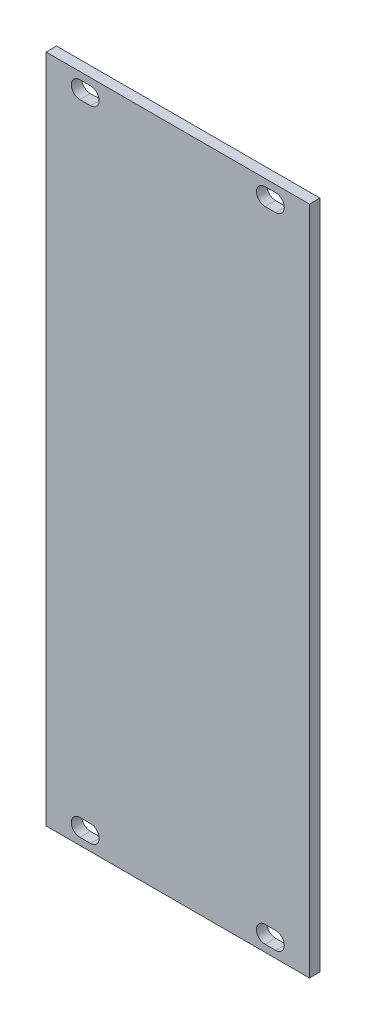
ISO-10303-21;
HEADER;
FILE_DESCRIPTION(('STEP AP214'),'2;1');
FILE_NAME('part.step','',(''),(''),'','','');
FILE_SCHEMA(('AUTOMOTIVE_DESIGN { 1 0 10303 214 1 1 1 1 }'));
ENDSEC;
DATA;
#1=APPLICATION_CONTEXT('core data for automotive mechanical design processes');
#2=APPLICATION_PROTOCOL_DEFINITION('international standard','automotive_design',2000,#1);
#3=PRODUCT_CONTEXT('',#1,'mechanical');
#4=PRODUCT('Part','Part','',(#3));
#5=PRODUCT_RELATED_PRODUCT_CATEGORY('part','',(#4));
#6=PRODUCT_DEFINITION_FORMATION('','',#4);
#7=PRODUCT_DEFINITION_CONTEXT('part definition',#1,'design');
#8=PRODUCT_DEFINITION('design','',#6,#7);
#9=PRODUCT_DEFINITION_SHAPE('','',#8);
#10=(LENGTH_UNIT() NAMED_UNIT(*) SI_UNIT(.MILLI.,.METRE.));
#11=(NAMED_UNIT(*) PLANE_ANGLE_UNIT() SI_UNIT($,.RADIAN.));
#12=(NAMED_UNIT(*) SI_UNIT($,.STERADIAN.) SOLID_ANGLE_UNIT());
#13=UNCERTAINTY_MEASURE_WITH_UNIT(LENGTH_MEASURE(1.E-05),#10,'distance_accuracy_value','');
#14=(GEOMETRIC_REPRESENTATION_CONTEXT(3) GLOBAL_UNCERTAINTY_ASSIGNED_CONTEXT((#13)) GLOBAL_UNIT_ASSIGNED_CONTEXT((#10,
#11,#12)) REPRESENTATION_CONTEXT('',''));
#15=CARTESIAN_POINT('',(0.,0.,0.));
#16=DIRECTION('',(0.,0.,1.));
#17=DIRECTION('',(1.,0.,0.));
#18=AXIS2_PLACEMENT_3D('',#15,#16,#17);
#19=CARTESIAN_POINT('',(0.,0.,2.));
#20=DIRECTION('',(0.,0.,1.));
#21=DIRECTION('',(1.,0.,0.));
#22=AXIS2_PLACEMENT_3D('',#19,#20,#21);
#23=PLANE('',#22);
#24=DIRECTION('',(0.,1.,0.));
#25=VECTOR('',#24,1.);
#26=CARTESIAN_POINT('',(25.25,64.25,2.));
#27=LINE('',#26,#25);
#28=CARTESIAN_POINT('',(25.25,-64.25,2.));
#29=VERTEX_POINT('',#28);
#30=CARTESIAN_POINT('',(25.25,64.25,2.));
#31=VERTEX_POINT('',#30);
#32=EDGE_CURVE('E360',#29,#31,#27,.T.);
#33=ORIENTED_EDGE('',*,*,#32,.T.);
#34=DIRECTION('',(-1.,0.,0.));
#35=VECTOR('',#34,1.);
#36=CARTESIAN_POINT('',(-25.25,64.25,2.));
#37=LINE('',#36,#35);
#38=CARTESIAN_POINT('',(-25.25,64.25,2.));
#39=VERTEX_POINT('',#38);
#40=EDGE_CURVE('E364',#31,#39,#37,.T.);
#41=ORIENTED_EDGE('',*,*,#40,.T.);
#42=DIRECTION('',(0.,-1.,0.));
#43=VECTOR('',#42,1.);
#44=CARTESIAN_POINT('',(-25.25,64.25,2.));
#45=LINE('',#44,#43);
#46=CARTESIAN_POINT('',(-25.25,-64.25,2.));
#47=VERTEX_POINT('',#46);
#48=EDGE_CURVE('E368',#39,#47,#45,.T.);
#49=ORIENTED_EDGE('',*,*,#48,.T.);
#50=DIRECTION('',(1.,0.,0.));
#51=VECTOR('',#50,1.);
#52=CARTESIAN_POINT('',(-25.25,-64.25,2.));
#53=LINE('',#52,#51);
#54=EDGE_CURVE('E371',#47,#29,#53,.T.);
#55=ORIENTED_EDGE('',*,*,#54,.T.);
#56=EDGE_LOOP('',(#33,#41,#49,#55));
#57=FACE_BOUND('',#56,.T.);
#58=DIRECTION('',(1.,0.,0.));
#59=VECTOR('',#58,1.);
#60=CARTESIAN_POINT('',(-18.766,-62.9,2.));
#61=LINE('',#60,#59);
#62=CARTESIAN_POINT('',(-18.766,-62.9,2.));
#63=VERTEX_POINT('',#62);
#64=CARTESIAN_POINT('',(-16.734,-62.9,2.));
#65=VERTEX_POINT('',#64);
#66=EDGE_CURVE('E320',#63,#65,#61,.T.);
#67=ORIENTED_EDGE('',*,*,#66,.F.);
#68=CARTESIAN_POINT('',(-18.766,-61.25,2.));
#69=DIRECTION('',(0.,0.,1.));
#70=DIRECTION('',(1.,0.,0.));
#71=AXIS2_PLACEMENT_3D('',#68,#69,#70);
#72=CIRCLE('',#71,1.65);
#73=CARTESIAN_POINT('',(-18.766,-59.6,2.));
#74=VERTEX_POINT('',#73);
#75=EDGE_CURVE('E317',#74,#63,#72,.T.);
#76=ORIENTED_EDGE('',*,*,#75,.F.);
#77=DIRECTION('',(-1.,0.,0.));
#78=VECTOR('',#77,1.);
#79=CARTESIAN_POINT('',(-18.766,-59.6,2.));
#80=LINE('',#79,#78);
#81=CARTESIAN_POINT('',(-16.734,-59.6,2.));
#82=VERTEX_POINT('',#81);
#83=EDGE_CURVE('E328',#82,#74,#80,.T.);
#84=ORIENTED_EDGE('',*,*,#83,.F.);
#85=CARTESIAN_POINT('',(-16.734,-61.25,2.));
#86=DIRECTION('',(0.,0.,1.));
#87=DIRECTION('',(1.,0.,0.));
#88=AXIS2_PLACEMENT_3D('',#85,#86,#87);
#89=CIRCLE('',#88,1.64999999999999);
#90=EDGE_CURVE('E324',#65,#82,#89,.T.);
#91=ORIENTED_EDGE('',*,*,#90,.F.);
#92=EDGE_LOOP('',(#67,#76,#84,#91));
#93=FACE_BOUND('',#92,.T.);
#94=DIRECTION('',(1.,0.,0.));
#95=VECTOR('',#94,1.);
#96=CARTESIAN_POINT('',(16.734000014,59.6,2.));
#97=LINE('',#96,#95);
#98=CARTESIAN_POINT('',(16.734000014,59.6,2.));
#99=VERTEX_POINT('',#98);
#100=CARTESIAN_POINT('',(18.766000014,59.6,2.));
#101=VERTEX_POINT('',#100);
#102=EDGE_CURVE('E277',#99,#101,#97,.T.);
#103=ORIENTED_EDGE('',*,*,#102,.F.);
#104=CARTESIAN_POINT('',(16.734000014,61.25,2.));
#105=DIRECTION('',(0.,0.,1.));
#106=DIRECTION('',(1.,0.,0.));
#107=AXIS2_PLACEMENT_3D('',#104,#105,#106);
#108=CIRCLE('',#107,1.64999999999999);
#109=CARTESIAN_POINT('',(16.734000014,62.9,2.));
#110=VERTEX_POINT('',#109);
#111=EDGE_CURVE('E274',#110,#99,#108,.T.);
#112=ORIENTED_EDGE('',*,*,#111,.F.);
#113=DIRECTION('',(-1.,0.,0.));
#114=VECTOR('',#113,1.);
#115=CARTESIAN_POINT('',(16.734000014,62.9,2.));
#116=LINE('',#115,#114);
#117=CARTESIAN_POINT('',(18.766000014,62.9,2.));
#118=VERTEX_POINT('',#117);
#119=EDGE_CURVE('E285',#118,#110,#116,.T.);
#120=ORIENTED_EDGE('',*,*,#119,.F.);
#121=CARTESIAN_POINT('',(18.766000014,61.25,2.));
#122=DIRECTION('',(0.,0.,1.));
#123=DIRECTION('',(1.,0.,0.));
#124=AXIS2_PLACEMENT_3D('',#121,#122,#123);
#125=CIRCLE('',#124,1.64999999999999);
#126=EDGE_CURVE('E281',#101,#118,#125,.T.);
#127=ORIENTED_EDGE('',*,*,#126,.F.);
#128=EDGE_LOOP('',(#103,#112,#120,#127));
#129=FACE_BOUND('',#128,.T.);
#130=DIRECTION('',(1.,0.,0.));
#131=VECTOR('',#130,1.);
#132=CARTESIAN_POINT('',(-18.766,59.6,2.));
#133=LINE('',#132,#131);
#134=CARTESIAN_POINT('',(-18.766,59.6,2.));
#135=VERTEX_POINT('',#134);
#136=CARTESIAN_POINT('',(-16.734,59.6,2.));
#137=VERTEX_POINT('',#136);
#138=EDGE_CURVE('E234',#135,#137,#133,.T.);
#139=ORIENTED_EDGE('',*,*,#138,.F.);
#140=CARTESIAN_POINT('',(-18.766,61.25,2.));
#141=DIRECTION('',(0.,0.,1.));
#142=DIRECTION('',(1.,0.,0.));
#143=AXIS2_PLACEMENT_3D('',#140,#141,#142);
#144=CIRCLE('',#143,1.64999999999999);
#145=CARTESIAN_POINT('',(-18.766,62.9,2.));
#146=VERTEX_POINT('',#145);
#147=EDGE_CURVE('E231',#146,#135,#144,.T.);
#148=ORIENTED_EDGE('',*,*,#147,.F.);
#149=DIRECTION('',(-1.,0.,0.));
#150=VECTOR('',#149,1.);
#151=CARTESIAN_POINT('',(-18.766,62.9,2.));
#152=LINE('',#151,#150);
#153=CARTESIAN_POINT('',(-16.734,62.9,2.));
#154=VERTEX_POINT('',#153);
#155=EDGE_CURVE('E242',#154,#146,#152,.T.);
#156=ORIENTED_EDGE('',*,*,#155,.F.);
#157=CARTESIAN_POINT('',(-16.734,61.25,2.));
#158=DIRECTION('',(0.,0.,1.));
#159=DIRECTION('',(1.,0.,0.));
#160=AXIS2_PLACEMENT_3D('',#157,#158,#159);
#161=CIRCLE('',#160,1.64999999999999);
#162=EDGE_CURVE('E238',#137,#154,#161,.T.);
#163=ORIENTED_EDGE('',*,*,#162,.F.);
#164=EDGE_LOOP('',(#139,#148,#156,#163));
#165=FACE_BOUND('',#164,.T.);
#166=DIRECTION('',(1.,0.,0.));
#167=VECTOR('',#166,1.);
#168=CARTESIAN_POINT('',(16.734000014,-62.9,2.));
#169=LINE('',#168,#167);
#170=CARTESIAN_POINT('',(16.734000014,-62.9,2.));
#171=VERTEX_POINT('',#170);
#172=CARTESIAN_POINT('',(18.766000014,-62.9,2.));
#173=VERTEX_POINT('',#172);
#174=EDGE_CURVE('E192',#171,#173,#169,.T.);
#175=ORIENTED_EDGE('',*,*,#174,.F.);
#176=CARTESIAN_POINT('',(16.734000014,-61.25,2.));
#177=DIRECTION('',(0.,0.,1.));
#178=DIRECTION('',(1.,0.,0.));
#179=AXIS2_PLACEMENT_3D('',#176,#177,#178);
#180=CIRCLE('',#179,1.65);
#181=CARTESIAN_POINT('',(16.734000014,-59.6,2.));
#182=VERTEX_POINT('',#181);
#183=EDGE_CURVE('E183',#182,#171,#180,.T.);
#184=ORIENTED_EDGE('',*,*,#183,.F.);
#185=DIRECTION('',(-1.,0.,0.));
#186=VECTOR('',#185,1.);
#187=CARTESIAN_POINT('',(16.734000014,-59.6,2.));
#188=LINE('',#187,#186);
#189=CARTESIAN_POINT('',(18.766000014,-59.6,2.));
#190=VERTEX_POINT('',#189);
#191=EDGE_CURVE('E209',#190,#182,#188,.T.);
#192=ORIENTED_EDGE('',*,*,#191,.F.);
#193=CARTESIAN_POINT('',(18.766000014,-61.25,2.));
#194=DIRECTION('',(0.,0.,1.));
#195=DIRECTION('',(1.,0.,0.));
#196=AXIS2_PLACEMENT_3D('',#193,#194,#195);
#197=CIRCLE('',#196,1.65);
#198=EDGE_CURVE('E205',#173,#190,#197,.T.);
#199=ORIENTED_EDGE('',*,*,#198,.F.);
#200=EDGE_LOOP('',(#175,#184,#192,#199));
#201=FACE_BOUND('',#200,.T.);
#202=ADVANCED_FACE('F45',(#57,#93,#129,#165,#201),#23,.T.);
#203=CARTESIAN_POINT('',(0.,0.,0.));
#204=DIRECTION('',(0.,0.,1.));
#205=DIRECTION('',(1.,0.,0.));
#206=AXIS2_PLACEMENT_3D('',#203,#204,#205);
#207=PLANE('',#206);
#208=CARTESIAN_POINT('',(-18.766,61.25,0.));
#209=DIRECTION('',(0.,0.,1.));
#210=DIRECTION('',(1.,0.,0.));
#211=AXIS2_PLACEMENT_3D('',#208,#209,#210);
#212=CIRCLE('',#211,1.64999999999999);
#213=CARTESIAN_POINT('',(-18.766,62.9,0.));
#214=VERTEX_POINT('',#213);
#215=CARTESIAN_POINT('',(-18.766,59.6,0.));
#216=VERTEX_POINT('',#215);
#217=EDGE_CURVE('E201',#214,#216,#212,.T.);
#218=ORIENTED_EDGE('',*,*,#217,.T.);
#219=DIRECTION('',(1.,0.,0.));
#220=VECTOR('',#219,1.);
#221=CARTESIAN_POINT('',(-18.766,59.6,0.));
#222=LINE('',#221,#220);
#223=CARTESIAN_POINT('',(-16.734,59.6,0.));
#224=VERTEX_POINT('',#223);
#225=EDGE_CURVE('E249',#216,#224,#222,.T.);
#226=ORIENTED_EDGE('',*,*,#225,.T.);
#227=CARTESIAN_POINT('',(-16.734,61.25,0.));
#228=DIRECTION('',(0.,0.,1.));
#229=DIRECTION('',(1.,0.,0.));
#230=AXIS2_PLACEMENT_3D('',#227,#228,#229);
#231=CIRCLE('',#230,1.64999999999999);
#232=CARTESIAN_POINT('',(-16.734,62.9,0.));
#233=VERTEX_POINT('',#232);
#234=EDGE_CURVE('E253',#224,#233,#231,.T.);
#235=ORIENTED_EDGE('',*,*,#234,.T.);
#236=DIRECTION('',(-1.,0.,0.));
#237=VECTOR('',#236,1.);
#238=CARTESIAN_POINT('',(-18.766,62.9,0.));
#239=LINE('',#238,#237);
#240=EDGE_CURVE('E235',#233,#214,#239,.T.);
#241=ORIENTED_EDGE('',*,*,#240,.T.);
#242=EDGE_LOOP('',(#218,#226,#235,#241));
#243=FACE_BOUND('',#242,.T.);
#244=CARTESIAN_POINT('',(-18.766,-61.25,0.));
#245=DIRECTION('',(0.,0.,1.));
#246=DIRECTION('',(1.,0.,0.));
#247=AXIS2_PLACEMENT_3D('',#244,#245,#246);
#248=CIRCLE('',#247,1.65);
#249=CARTESIAN_POINT('',(-18.766,-59.6,0.));
#250=VERTEX_POINT('',#249);
#251=CARTESIAN_POINT('',(-18.766,-62.9,0.));
#252=VERTEX_POINT('',#251);
#253=EDGE_CURVE('E316',#250,#252,#248,.T.);
#254=ORIENTED_EDGE('',*,*,#253,.T.);
#255=DIRECTION('',(1.,0.,0.));
#256=VECTOR('',#255,1.);
#257=CARTESIAN_POINT('',(-18.766,-62.9,0.));
#258=LINE('',#257,#256);
#259=CARTESIAN_POINT('',(-16.734,-62.9,0.));
#260=VERTEX_POINT('',#259);
#261=EDGE_CURVE('E335',#252,#260,#258,.T.);
#262=ORIENTED_EDGE('',*,*,#261,.T.);
#263=CARTESIAN_POINT('',(-16.734,-61.25,0.));
#264=DIRECTION('',(0.,0.,1.));
#265=DIRECTION('',(1.,0.,0.));
#266=AXIS2_PLACEMENT_3D('',#263,#264,#265);
#267=CIRCLE('',#266,1.64999999999999);
#268=CARTESIAN_POINT('',(-16.734,-59.6,0.));
#269=VERTEX_POINT('',#268);
#270=EDGE_CURVE('E339',#260,#269,#267,.T.);
#271=ORIENTED_EDGE('',*,*,#270,.T.);
#272=DIRECTION('',(-1.,0.,0.));
#273=VECTOR('',#272,1.);
#274=CARTESIAN_POINT('',(-18.766,-59.6,0.));
#275=LINE('',#274,#273);
#276=EDGE_CURVE('E321',#269,#250,#275,.T.);
#277=ORIENTED_EDGE('',*,*,#276,.T.);
#278=EDGE_LOOP('',(#254,#262,#271,#277));
#279=FACE_BOUND('',#278,.T.);
#280=DIRECTION('',(0.,1.,0.));
#281=VECTOR('',#280,1.);
#282=CARTESIAN_POINT('',(25.25,64.25,0.));
#283=LINE('',#282,#281);
#284=CARTESIAN_POINT('',(25.25,-64.25,0.));
#285=VERTEX_POINT('',#284);
#286=CARTESIAN_POINT('',(25.25,64.25,0.));
#287=VERTEX_POINT('',#286);
#288=EDGE_CURVE('E359',#285,#287,#283,.T.);
#289=ORIENTED_EDGE('',*,*,#288,.F.);
#290=DIRECTION('',(1.,0.,0.));
#291=VECTOR('',#290,1.);
#292=CARTESIAN_POINT('',(-25.25,-64.25,0.));
#293=LINE('',#292,#291);
#294=CARTESIAN_POINT('',(-25.25,-64.25,0.));
#295=VERTEX_POINT('',#294);
#296=EDGE_CURVE('E365',#295,#285,#293,.T.);
#297=ORIENTED_EDGE('',*,*,#296,.F.);
#298=DIRECTION('',(0.,-1.,0.));
#299=VECTOR('',#298,1.);
#300=CARTESIAN_POINT('',(-25.25,64.25,0.));
#301=LINE('',#300,#299);
#302=CARTESIAN_POINT('',(-25.25,64.25,0.));
#303=VERTEX_POINT('',#302);
#304=EDGE_CURVE('E381',#303,#295,#301,.T.);
#305=ORIENTED_EDGE('',*,*,#304,.F.);
#306=DIRECTION('',(-1.,0.,0.));
#307=VECTOR('',#306,1.);
#308=CARTESIAN_POINT('',(-25.25,64.25,0.));
#309=LINE('',#308,#307);
#310=EDGE_CURVE('E378',#287,#303,#309,.T.);
#311=ORIENTED_EDGE('',*,*,#310,.F.);
#312=EDGE_LOOP('',(#289,#297,#305,#311));
#313=FACE_BOUND('',#312,.T.);
#314=CARTESIAN_POINT('',(16.734000014,61.25,0.));
#315=DIRECTION('',(0.,0.,1.));
#316=DIRECTION('',(1.,0.,0.));
#317=AXIS2_PLACEMENT_3D('',#314,#315,#316);
#318=CIRCLE('',#317,1.64999999999999);
#319=CARTESIAN_POINT('',(16.734000014,62.9,0.));
#320=VERTEX_POINT('',#319);
#321=CARTESIAN_POINT('',(16.734000014,59.6,0.));
#322=VERTEX_POINT('',#321);
#323=EDGE_CURVE('E273',#320,#322,#318,.T.);
#324=ORIENTED_EDGE('',*,*,#323,.T.);
#325=DIRECTION('',(1.,0.,0.));
#326=VECTOR('',#325,1.);
#327=CARTESIAN_POINT('',(16.734000014,59.6,0.));
#328=LINE('',#327,#326);
#329=CARTESIAN_POINT('',(18.766000014,59.6,0.));
#330=VERTEX_POINT('',#329);
#331=EDGE_CURVE('E292',#322,#330,#328,.T.);
#332=ORIENTED_EDGE('',*,*,#331,.T.);
#333=CARTESIAN_POINT('',(18.766000014,61.25,0.));
#334=DIRECTION('',(0.,0.,1.));
#335=DIRECTION('',(1.,0.,0.));
#336=AXIS2_PLACEMENT_3D('',#333,#334,#335);
#337=CIRCLE('',#336,1.64999999999999);
#338=CARTESIAN_POINT('',(18.766000014,62.9,0.));
#339=VERTEX_POINT('',#338);
#340=EDGE_CURVE('E296',#330,#339,#337,.T.);
#341=ORIENTED_EDGE('',*,*,#340,.T.);
#342=DIRECTION('',(-1.,0.,0.));
#343=VECTOR('',#342,1.);
#344=CARTESIAN_POINT('',(16.734000014,62.9,0.));
#345=LINE('',#344,#343);
#346=EDGE_CURVE('E278',#339,#320,#345,.T.);
#347=ORIENTED_EDGE('',*,*,#346,.T.);
#348=EDGE_LOOP('',(#324,#332,#341,#347));
#349=FACE_BOUND('',#348,.T.);
#350=CARTESIAN_POINT('',(16.734000014,-61.25,0.));
#351=DIRECTION('',(0.,0.,1.));
#352=DIRECTION('',(1.,0.,0.));
#353=AXIS2_PLACEMENT_3D('',#350,#351,#352);
#354=CIRCLE('',#353,1.65);
#355=CARTESIAN_POINT('',(16.734000014,-59.6,0.));
#356=VERTEX_POINT('',#355);
#357=CARTESIAN_POINT('',(16.734000014,-62.9,0.));
#358=VERTEX_POINT('',#357);
#359=EDGE_CURVE('E69',#356,#358,#354,.T.);
#360=ORIENTED_EDGE('',*,*,#359,.T.);
#361=DIRECTION('',(1.,0.,0.));
#362=VECTOR('',#361,1.);
#363=CARTESIAN_POINT('',(16.734000014,-62.9,0.));
#364=LINE('',#363,#362);
#365=CARTESIAN_POINT('',(18.766000014,-62.9,0.));
#366=VERTEX_POINT('',#365);
#367=EDGE_CURVE('E199',#358,#366,#364,.T.);
#368=ORIENTED_EDGE('',*,*,#367,.T.);
#369=CARTESIAN_POINT('',(18.766000014,-61.25,0.));
#370=DIRECTION('',(0.,0.,1.));
#371=DIRECTION('',(1.,0.,0.));
#372=AXIS2_PLACEMENT_3D('',#369,#370,#371);
#373=CIRCLE('',#372,1.65);
#374=CARTESIAN_POINT('',(18.766000014,-59.6,0.));
#375=VERTEX_POINT('',#374);
#376=EDGE_CURVE('E218',#366,#375,#373,.T.);
#377=ORIENTED_EDGE('',*,*,#376,.T.);
#378=DIRECTION('',(-1.,0.,0.));
#379=VECTOR('',#378,1.);
#380=CARTESIAN_POINT('',(16.734000014,-59.6,0.));
#381=LINE('',#380,#379);
#382=EDGE_CURVE('E193',#375,#356,#381,.T.);
#383=ORIENTED_EDGE('',*,*,#382,.T.);
#384=EDGE_LOOP('',(#360,#368,#377,#383));
#385=FACE_BOUND('',#384,.T.);
#386=ADVANCED_FACE('F404',(#243,#279,#313,#349,#385),#207,.F.);
#387=CARTESIAN_POINT('',(25.25,64.25,2.));
#388=DIRECTION('',(-1.,0.,0.));
#389=DIRECTION('',(0.,-1.,0.));
#390=AXIS2_PLACEMENT_3D('',#387,#388,#389);
#391=PLANE('',#390);
#392=ORIENTED_EDGE('',*,*,#288,.T.);
#393=DIRECTION('',(0.,0.,-1.));
#394=VECTOR('',#393,1.);
#395=CARTESIAN_POINT('',(25.25,64.25,2.));
#396=LINE('',#395,#394);
#397=EDGE_CURVE('E11',#31,#287,#396,.T.);
#398=ORIENTED_EDGE('',*,*,#397,.F.);
#399=ORIENTED_EDGE('',*,*,#32,.F.);
#400=DIRECTION('',(0.,0.,-1.));
#401=VECTOR('',#400,1.);
#402=CARTESIAN_POINT('',(25.25,-64.25,2.));
#403=LINE('',#402,#401);
#404=EDGE_CURVE('E374',#29,#285,#403,.T.);
#405=ORIENTED_EDGE('',*,*,#404,.T.);
#406=EDGE_LOOP('',(#392,#398,#399,#405));
#407=FACE_BOUND('',#406,.T.);
#408=ADVANCED_FACE('F47',(#407),#391,.F.);
#409=CARTESIAN_POINT('',(-25.25,64.25,2.));
#410=DIRECTION('',(0.,-1.,0.));
#411=DIRECTION('',(0.,0.,-1.));
#412=AXIS2_PLACEMENT_3D('',#409,#410,#411);
#413=PLANE('',#412);
#414=ORIENTED_EDGE('',*,*,#310,.T.);
#415=DIRECTION('',(0.,0.,-1.));
#416=VECTOR('',#415,1.);
#417=CARTESIAN_POINT('',(-25.25,64.25,2.));
#418=LINE('',#417,#416);
#419=EDGE_CURVE('E54',#39,#303,#418,.T.);
#420=ORIENTED_EDGE('',*,*,#419,.F.);
#421=ORIENTED_EDGE('',*,*,#40,.F.);
#422=ORIENTED_EDGE('',*,*,#397,.T.);
#423=EDGE_LOOP('',(#414,#420,#421,#422));
#424=FACE_BOUND('',#423,.T.);
#425=ADVANCED_FACE('F415',(#424),#413,.F.);
#426=CARTESIAN_POINT('',(-25.25,64.25,2.));
#427=DIRECTION('',(1.,0.,0.));
#428=DIRECTION('',(0.,1.,0.));
#429=AXIS2_PLACEMENT_3D('',#426,#427,#428);
#430=PLANE('',#429);
#431=ORIENTED_EDGE('',*,*,#304,.T.);
#432=DIRECTION('',(0.,0.,-1.));
#433=VECTOR('',#432,1.);
#434=CARTESIAN_POINT('',(-25.25,-64.25,2.));
#435=LINE('',#434,#433);
#436=EDGE_CURVE('E389',#47,#295,#435,.T.);
#437=ORIENTED_EDGE('',*,*,#436,.F.);
#438=ORIENTED_EDGE('',*,*,#48,.F.);
#439=ORIENTED_EDGE('',*,*,#419,.T.);
#440=EDGE_LOOP('',(#431,#437,#438,#439));
#441=FACE_BOUND('',#440,.T.);
#442=ADVANCED_FACE('F398',(#441),#430,.F.);
#443=CARTESIAN_POINT('',(-25.25,-64.25,2.));
#444=DIRECTION('',(0.,1.,0.));
#445=DIRECTION('',(0.,0.,1.));
#446=AXIS2_PLACEMENT_3D('',#443,#444,#445);
#447=PLANE('',#446);
#448=ORIENTED_EDGE('',*,*,#296,.T.);
#449=ORIENTED_EDGE('',*,*,#404,.F.);
#450=ORIENTED_EDGE('',*,*,#54,.F.);
#451=ORIENTED_EDGE('',*,*,#436,.T.);
#452=EDGE_LOOP('',(#448,#449,#450,#451));
#453=FACE_BOUND('',#452,.T.);
#454=ADVANCED_FACE('F408',(#453),#447,.F.);
#455=CARTESIAN_POINT('',(-18.766,-61.25,2.));
#456=DIRECTION('',(0.,0.,-1.));
#457=DIRECTION('',(-1.,0.,0.));
#458=AXIS2_PLACEMENT_3D('',#455,#456,#457);
#459=CYLINDRICAL_SURFACE('',#458,1.65);
#460=ORIENTED_EDGE('',*,*,#253,.F.);
#461=DIRECTION('',(0.,0.,-1.));
#462=VECTOR('',#461,1.);
#463=CARTESIAN_POINT('',(-18.766,-59.6,2.));
#464=LINE('',#463,#462);
#465=EDGE_CURVE('E331',#74,#250,#464,.T.);
#466=ORIENTED_EDGE('',*,*,#465,.F.);
#467=ORIENTED_EDGE('',*,*,#75,.T.);
#468=DIRECTION('',(0.,0.,-1.));
#469=VECTOR('',#468,1.);
#470=CARTESIAN_POINT('',(-18.766,-62.9,2.));
#471=LINE('',#470,#469);
#472=EDGE_CURVE('E355',#63,#252,#471,.T.);
#473=ORIENTED_EDGE('',*,*,#472,.T.);
#474=EDGE_LOOP('',(#460,#466,#467,#473));
#475=FACE_BOUND('',#474,.T.);
#476=ADVANCED_FACE('F430',(#475),#459,.F.);
#477=CARTESIAN_POINT('',(-18.766,-62.9,2.));
#478=DIRECTION('',(0.,1.,0.));
#479=DIRECTION('',(-1.,0.,0.));
#480=AXIS2_PLACEMENT_3D('',#477,#478,#479);
#481=PLANE('',#480);
#482=ORIENTED_EDGE('',*,*,#261,.F.);
#483=ORIENTED_EDGE('',*,*,#472,.F.);
#484=ORIENTED_EDGE('',*,*,#66,.T.);
#485=DIRECTION('',(0.,0.,-1.));
#486=VECTOR('',#485,1.);
#487=CARTESIAN_POINT('',(-16.734,-62.9,2.));
#488=LINE('',#487,#486);
#489=EDGE_CURVE('E352',#65,#260,#488,.T.);
#490=ORIENTED_EDGE('',*,*,#489,.T.);
#491=EDGE_LOOP('',(#482,#483,#484,#490));
#492=FACE_BOUND('',#491,.T.);
#493=ADVANCED_FACE('F437',(#492),#481,.T.);
#494=CARTESIAN_POINT('',(-16.734,-61.25,2.));
#495=DIRECTION('',(0.,0.,-1.));
#496=DIRECTION('',(-1.,0.,0.));
#497=AXIS2_PLACEMENT_3D('',#494,#495,#496);
#498=CYLINDRICAL_SURFACE('',#497,1.64999999999999);
#499=ORIENTED_EDGE('',*,*,#270,.F.);
#500=ORIENTED_EDGE('',*,*,#489,.F.);
#501=ORIENTED_EDGE('',*,*,#90,.T.);
#502=DIRECTION('',(0.,0.,-1.));
#503=VECTOR('',#502,1.);
#504=CARTESIAN_POINT('',(-16.734,-59.6,2.));
#505=LINE('',#504,#503);
#506=EDGE_CURVE('E349',#82,#269,#505,.T.);
#507=ORIENTED_EDGE('',*,*,#506,.T.);
#508=EDGE_LOOP('',(#499,#500,#501,#507));
#509=FACE_BOUND('',#508,.T.);
#510=ADVANCED_FACE('F442',(#509),#498,.F.);
#511=CARTESIAN_POINT('',(-18.766,-59.6,2.));
#512=DIRECTION('',(0.,-1.,0.));
#513=DIRECTION('',(0.,0.,-1.));
#514=AXIS2_PLACEMENT_3D('',#511,#512,#513);
#515=PLANE('',#514);
#516=ORIENTED_EDGE('',*,*,#276,.F.);
#517=ORIENTED_EDGE('',*,*,#506,.F.);
#518=ORIENTED_EDGE('',*,*,#83,.T.);
#519=ORIENTED_EDGE('',*,*,#465,.T.);
#520=EDGE_LOOP('',(#516,#517,#518,#519));
#521=FACE_BOUND('',#520,.T.);
#522=ADVANCED_FACE('F450',(#521),#515,.T.);
#523=CARTESIAN_POINT('',(16.734000014,61.25,2.));
#524=DIRECTION('',(0.,0.,-1.));
#525=DIRECTION('',(-1.,0.,0.));
#526=AXIS2_PLACEMENT_3D('',#523,#524,#525);
#527=CYLINDRICAL_SURFACE('',#526,1.64999999999999);
#528=ORIENTED_EDGE('',*,*,#323,.F.);
#529=DIRECTION('',(0.,0.,-1.));
#530=VECTOR('',#529,1.);
#531=CARTESIAN_POINT('',(16.734000014,62.9,2.));
#532=LINE('',#531,#530);
#533=EDGE_CURVE('E288',#110,#320,#532,.T.);
#534=ORIENTED_EDGE('',*,*,#533,.F.);
#535=ORIENTED_EDGE('',*,*,#111,.T.);
#536=DIRECTION('',(0.,0.,-1.));
#537=VECTOR('',#536,1.);
#538=CARTESIAN_POINT('',(16.734000014,59.6,2.));
#539=LINE('',#538,#537);
#540=EDGE_CURVE('E312',#99,#322,#539,.T.);
#541=ORIENTED_EDGE('',*,*,#540,.T.);
#542=EDGE_LOOP('',(#528,#534,#535,#541));
#543=FACE_BOUND('',#542,.T.);
#544=ADVANCED_FACE('F504',(#543),#527,.F.);
#545=CARTESIAN_POINT('',(16.734000014,59.6,2.));
#546=DIRECTION('',(0.,1.,0.));
#547=DIRECTION('',(0.,0.,1.));
#548=AXIS2_PLACEMENT_3D('',#545,#546,#547);
#549=PLANE('',#548);
#550=ORIENTED_EDGE('',*,*,#331,.F.);
#551=ORIENTED_EDGE('',*,*,#540,.F.);
#552=ORIENTED_EDGE('',*,*,#102,.T.);
#553=DIRECTION('',(0.,0.,-1.));
#554=VECTOR('',#553,1.);
#555=CARTESIAN_POINT('',(18.766000014,59.6,2.));
#556=LINE('',#555,#554);
#557=EDGE_CURVE('E309',#101,#330,#556,.T.);
#558=ORIENTED_EDGE('',*,*,#557,.T.);
#559=EDGE_LOOP('',(#550,#551,#552,#558));
#560=FACE_BOUND('',#559,.T.);
#561=ADVANCED_FACE('F500',(#560),#549,.T.);
#562=CARTESIAN_POINT('',(18.766000014,61.25,2.));
#563=DIRECTION('',(0.,0.,-1.));
#564=DIRECTION('',(-1.,0.,0.));
#565=AXIS2_PLACEMENT_3D('',#562,#563,#564);
#566=CYLINDRICAL_SURFACE('',#565,1.64999999999999);
#567=ORIENTED_EDGE('',*,*,#340,.F.);
#568=ORIENTED_EDGE('',*,*,#557,.F.);
#569=ORIENTED_EDGE('',*,*,#126,.T.);
#570=DIRECTION('',(0.,0.,-1.));
#571=VECTOR('',#570,1.);
#572=CARTESIAN_POINT('',(18.766000014,62.9,2.));
#573=LINE('',#572,#571);
#574=EDGE_CURVE('E306',#118,#339,#573,.T.);
#575=ORIENTED_EDGE('',*,*,#574,.T.);
#576=EDGE_LOOP('',(#567,#568,#569,#575));
#577=FACE_BOUND('',#576,.T.);
#578=ADVANCED_FACE('F496',(#577),#566,.F.);
#579=CARTESIAN_POINT('',(16.734000014,62.9,2.));
#580=DIRECTION('',(0.,-1.,0.));
#581=DIRECTION('',(0.,0.,-1.));
#582=AXIS2_PLACEMENT_3D('',#579,#580,#581);
#583=PLANE('',#582);
#584=ORIENTED_EDGE('',*,*,#346,.F.);
#585=ORIENTED_EDGE('',*,*,#574,.F.);
#586=ORIENTED_EDGE('',*,*,#119,.T.);
#587=ORIENTED_EDGE('',*,*,#533,.T.);
#588=EDGE_LOOP('',(#584,#585,#586,#587));
#589=FACE_BOUND('',#588,.T.);
#590=ADVANCED_FACE('F493',(#589),#583,.T.);
#591=CARTESIAN_POINT('',(-18.766,61.25,2.));
#592=DIRECTION('',(0.,0.,-1.));
#593=DIRECTION('',(-1.,0.,0.));
#594=AXIS2_PLACEMENT_3D('',#591,#592,#593);
#595=CYLINDRICAL_SURFACE('',#594,1.64999999999999);
#596=ORIENTED_EDGE('',*,*,#217,.F.);
#597=DIRECTION('',(0.,0.,-1.));
#598=VECTOR('',#597,1.);
#599=CARTESIAN_POINT('',(-18.766,62.9,2.));
#600=LINE('',#599,#598);
#601=EDGE_CURVE('E245',#146,#214,#600,.T.);
#602=ORIENTED_EDGE('',*,*,#601,.F.);
#603=ORIENTED_EDGE('',*,*,#147,.T.);
#604=DIRECTION('',(0.,0.,-1.));
#605=VECTOR('',#604,1.);
#606=CARTESIAN_POINT('',(-18.766,59.6,2.));
#607=LINE('',#606,#605);
#608=EDGE_CURVE('E269',#135,#216,#607,.T.);
#609=ORIENTED_EDGE('',*,*,#608,.T.);
#610=EDGE_LOOP('',(#596,#602,#603,#609));
#611=FACE_BOUND('',#610,.T.);
#612=ADVANCED_FACE('F475',(#611),#595,.F.);
#613=CARTESIAN_POINT('',(-18.766,59.6,2.));
#614=DIRECTION('',(0.,1.,0.));
#615=DIRECTION('',(0.,0.,1.));
#616=AXIS2_PLACEMENT_3D('',#613,#614,#615);
#617=PLANE('',#616);
#618=ORIENTED_EDGE('',*,*,#225,.F.);
#619=ORIENTED_EDGE('',*,*,#608,.F.);
#620=ORIENTED_EDGE('',*,*,#138,.T.);
#621=DIRECTION('',(0.,0.,-1.));
#622=VECTOR('',#621,1.);
#623=CARTESIAN_POINT('',(-16.734,59.6,2.));
#624=LINE('',#623,#622);
#625=EDGE_CURVE('E266',#137,#224,#624,.T.);
#626=ORIENTED_EDGE('',*,*,#625,.T.);
#627=EDGE_LOOP('',(#618,#619,#620,#626));
#628=FACE_BOUND('',#627,.T.);
#629=ADVANCED_FACE('F469',(#628),#617,.T.);
#630=CARTESIAN_POINT('',(-16.734,61.25,2.));
#631=DIRECTION('',(0.,0.,-1.));
#632=DIRECTION('',(-1.,0.,0.));
#633=AXIS2_PLACEMENT_3D('',#630,#631,#632);
#634=CYLINDRICAL_SURFACE('',#633,1.64999999999999);
#635=ORIENTED_EDGE('',*,*,#234,.F.);
#636=ORIENTED_EDGE('',*,*,#625,.F.);
#637=ORIENTED_EDGE('',*,*,#162,.T.);
#638=DIRECTION('',(0.,0.,-1.));
#639=VECTOR('',#638,1.);
#640=CARTESIAN_POINT('',(-16.734,62.9,2.));
#641=LINE('',#640,#639);
#642=EDGE_CURVE('E263',#154,#233,#641,.T.);
#643=ORIENTED_EDGE('',*,*,#642,.T.);
#644=EDGE_LOOP('',(#635,#636,#637,#643));
#645=FACE_BOUND('',#644,.T.);
#646=ADVANCED_FACE('F472',(#645),#634,.F.);
#647=CARTESIAN_POINT('',(-18.766,62.9,2.));
#648=DIRECTION('',(0.,-1.,0.));
#649=DIRECTION('',(0.,0.,-1.));
#650=AXIS2_PLACEMENT_3D('',#647,#648,#649);
#651=PLANE('',#650);
#652=ORIENTED_EDGE('',*,*,#240,.F.);
#653=ORIENTED_EDGE('',*,*,#642,.F.);
#654=ORIENTED_EDGE('',*,*,#155,.T.);
#655=ORIENTED_EDGE('',*,*,#601,.T.);
#656=EDGE_LOOP('',(#652,#653,#654,#655));
#657=FACE_BOUND('',#656,.T.);
#658=ADVANCED_FACE('F478',(#657),#651,.T.);
#659=CARTESIAN_POINT('',(16.734000014,-61.25,2.));
#660=DIRECTION('',(0.,0.,-1.));
#661=DIRECTION('',(-1.,0.,0.));
#662=AXIS2_PLACEMENT_3D('',#659,#660,#661);
#663=CYLINDRICAL_SURFACE('',#662,1.65);
#664=ORIENTED_EDGE('',*,*,#359,.F.);
#665=DIRECTION('',(0.,0.,-1.));
#666=VECTOR('',#665,1.);
#667=CARTESIAN_POINT('',(16.734000014,-59.6,2.));
#668=LINE('',#667,#666);
#669=EDGE_CURVE('E187',#182,#356,#668,.T.);
#670=ORIENTED_EDGE('',*,*,#669,.F.);
#671=ORIENTED_EDGE('',*,*,#183,.T.);
#672=DIRECTION('',(0.,0.,-1.));
#673=VECTOR('',#672,1.);
#674=CARTESIAN_POINT('',(16.734000014,-62.9,2.));
#675=LINE('',#674,#673);
#676=EDGE_CURVE('E186',#171,#358,#675,.T.);
#677=ORIENTED_EDGE('',*,*,#676,.T.);
#678=EDGE_LOOP('',(#664,#670,#671,#677));
#679=FACE_BOUND('',#678,.T.);
#680=ADVANCED_FACE('F185',(#679),#663,.F.);
#681=CARTESIAN_POINT('',(16.734000014,-62.9,2.));
#682=DIRECTION('',(0.,1.,0.));
#683=DIRECTION('',(0.,0.,1.));
#684=AXIS2_PLACEMENT_3D('',#681,#682,#683);
#685=PLANE('',#684);
#686=ORIENTED_EDGE('',*,*,#367,.F.);
#687=ORIENTED_EDGE('',*,*,#676,.F.);
#688=ORIENTED_EDGE('',*,*,#174,.T.);
#689=DIRECTION('',(0.,0.,-1.));
#690=VECTOR('',#689,1.);
#691=CARTESIAN_POINT('',(18.766000014,-62.9,2.));
#692=LINE('',#691,#690);
#693=EDGE_CURVE('E202',#173,#366,#692,.T.);
#694=ORIENTED_EDGE('',*,*,#693,.T.);
#695=EDGE_LOOP('',(#686,#687,#688,#694));
#696=FACE_BOUND('',#695,.T.);
#697=ADVANCED_FACE('F196',(#696),#685,.T.);
#698=CARTESIAN_POINT('',(18.766000014,-61.25,2.));
#699=DIRECTION('',(0.,0.,-1.));
#700=DIRECTION('',(-1.,0.,0.));
#701=AXIS2_PLACEMENT_3D('',#698,#699,#700);
#702=CYLINDRICAL_SURFACE('',#701,1.65);
#703=ORIENTED_EDGE('',*,*,#376,.F.);
#704=ORIENTED_EDGE('',*,*,#693,.F.);
#705=ORIENTED_EDGE('',*,*,#198,.T.);
#706=DIRECTION('',(0.,0.,-1.));
#707=VECTOR('',#706,1.);
#708=CARTESIAN_POINT('',(18.766000014,-59.6,2.));
#709=LINE('',#708,#707);
#710=EDGE_CURVE('E61',#190,#375,#709,.T.);
#711=ORIENTED_EDGE('',*,*,#710,.T.);
#712=EDGE_LOOP('',(#703,#704,#705,#711));
#713=FACE_BOUND('',#712,.T.);
#714=ADVANCED_FACE('F576',(#713),#702,.F.);
#715=CARTESIAN_POINT('',(16.734000014,-59.6,2.));
#716=DIRECTION('',(0.,-1.,0.));
#717=DIRECTION('',(0.,0.,-1.));
#718=AXIS2_PLACEMENT_3D('',#715,#716,#717);
#719=PLANE('',#718);
#720=ORIENTED_EDGE('',*,*,#382,.F.);
#721=ORIENTED_EDGE('',*,*,#710,.F.);
#722=ORIENTED_EDGE('',*,*,#191,.T.);
#723=ORIENTED_EDGE('',*,*,#669,.T.);
#724=EDGE_LOOP('',(#720,#721,#722,#723));
#725=FACE_BOUND('',#724,.T.);
#726=ADVANCED_FACE('F584',(#725),#719,.T.);
#727=CLOSED_SHELL('',(#202,#386,#408,#425,#442,#454,#476,#493,#510,#522,#544,#561,#578,#590,
#612,#629,#646,#658,#680,#697,#714,#726));
#728=MANIFOLD_SOLID_BREP('B2',#727);
#729=ADVANCED_BREP_SHAPE_REPRESENTATION('',(#18,#728),#14);
#730=SHAPE_DEFINITION_REPRESENTATION(#9,#729);
ENDSEC;
END-ISO-10303-21;
